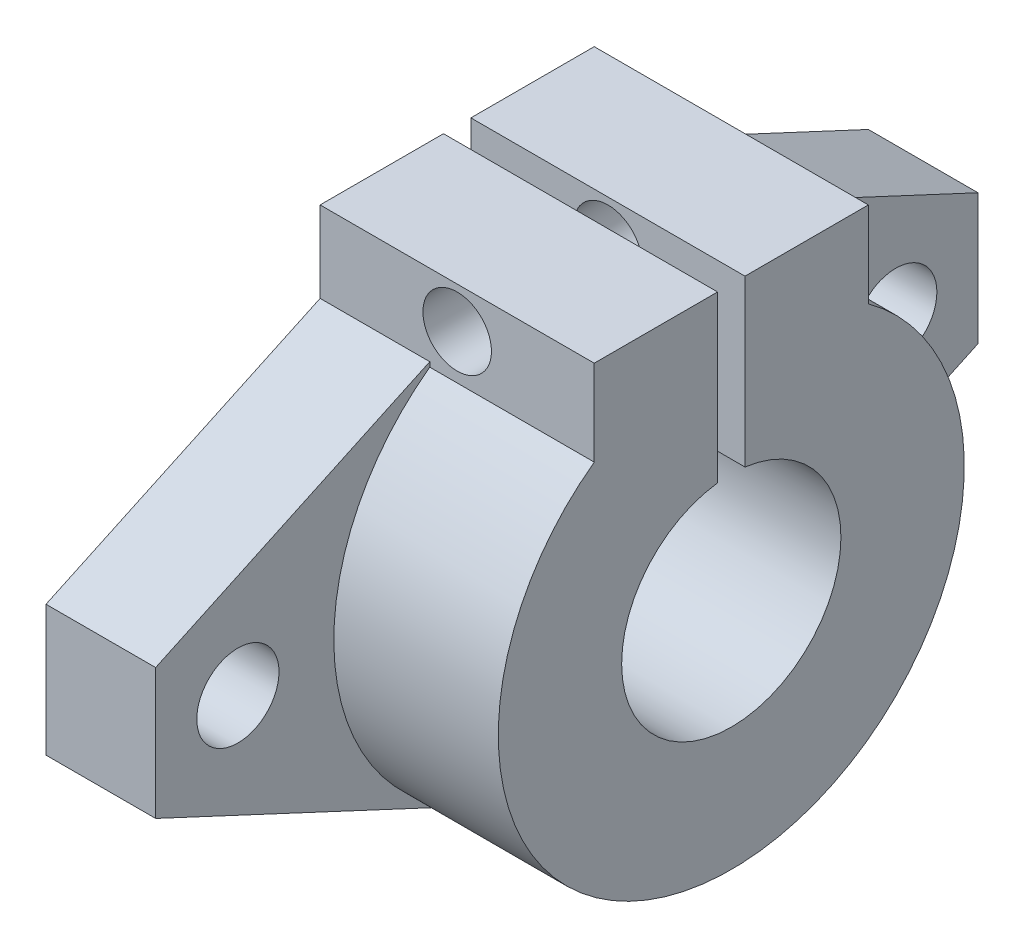
ISO-10303-21;
HEADER;
FILE_DESCRIPTION(('STEP AP214'),'2;1');
FILE_NAME('part.step','',(''),(''),'','','');
FILE_SCHEMA(('AUTOMOTIVE_DESIGN { 1 0 10303 214 1 1 1 1 }'));
ENDSEC;
DATA;
#1=APPLICATION_CONTEXT('core data for automotive mechanical design processes');
#2=APPLICATION_PROTOCOL_DEFINITION('international standard','automotive_design',2000,#1);
#3=PRODUCT_CONTEXT('',#1,'mechanical');
#4=PRODUCT('Part','Part','',(#3));
#5=PRODUCT_RELATED_PRODUCT_CATEGORY('part','',(#4));
#6=PRODUCT_DEFINITION_FORMATION('','',#4);
#7=PRODUCT_DEFINITION_CONTEXT('part definition',#1,'design');
#8=PRODUCT_DEFINITION('design','',#6,#7);
#9=PRODUCT_DEFINITION_SHAPE('','',#8);
#10=(LENGTH_UNIT() NAMED_UNIT(*) SI_UNIT(.MILLI.,.METRE.));
#11=(NAMED_UNIT(*) PLANE_ANGLE_UNIT() SI_UNIT($,.RADIAN.));
#12=(NAMED_UNIT(*) SI_UNIT($,.STERADIAN.) SOLID_ANGLE_UNIT());
#13=UNCERTAINTY_MEASURE_WITH_UNIT(LENGTH_MEASURE(1.E-05),#10,'distance_accuracy_value','');
#14=(GEOMETRIC_REPRESENTATION_CONTEXT(3) GLOBAL_UNCERTAINTY_ASSIGNED_CONTEXT((#13)) GLOBAL_UNIT_ASSIGNED_CONTEXT((#10,
#11,#12)) REPRESENTATION_CONTEXT('',''));
#15=CARTESIAN_POINT('',(0.,0.,0.));
#16=DIRECTION('',(0.,0.,1.));
#17=DIRECTION('',(1.,0.,0.));
#18=AXIS2_PLACEMENT_3D('',#15,#16,#17);
#19=CARTESIAN_POINT('',(0.,20.,0.));
#20=DIRECTION('',(0.,-1.,0.));
#21=DIRECTION('',(0.,0.,-1.));
#22=AXIS2_PLACEMENT_3D('',#19,#20,#21);
#23=PLANE('',#22);
#24=DIRECTION('',(0.,0.,-1.));
#25=VECTOR('',#24,1.);
#26=CARTESIAN_POINT('',(20.,20.,10.));
#27=LINE('',#26,#25);
#28=CARTESIAN_POINT('',(20.,20.,10.));
#29=VERTEX_POINT('',#28);
#30=CARTESIAN_POINT('',(20.,20.,1.));
#31=VERTEX_POINT('',#30);
#32=EDGE_CURVE('E305',#29,#31,#27,.T.);
#33=ORIENTED_EDGE('',*,*,#32,.T.);
#34=DIRECTION('',(1.,0.,0.));
#35=VECTOR('',#34,1.);
#36=CARTESIAN_POINT('',(0.,20.,1.));
#37=LINE('',#36,#35);
#38=CARTESIAN_POINT('',(0.,20.,1.));
#39=VERTEX_POINT('',#38);
#40=EDGE_CURVE('E155',#39,#31,#37,.T.);
#41=ORIENTED_EDGE('',*,*,#40,.F.);
#42=DIRECTION('',(0.,0.,-1.));
#43=VECTOR('',#42,1.);
#44=CARTESIAN_POINT('',(0.,20.,10.));
#45=LINE('',#44,#43);
#46=CARTESIAN_POINT('',(0.,20.,10.));
#47=VERTEX_POINT('',#46);
#48=EDGE_CURVE('E173',#47,#39,#45,.T.);
#49=ORIENTED_EDGE('',*,*,#48,.F.);
#50=DIRECTION('',(1.,0.,0.));
#51=VECTOR('',#50,1.);
#52=CARTESIAN_POINT('',(0.,20.,10.));
#53=LINE('',#52,#51);
#54=EDGE_CURVE('E180',#47,#29,#53,.T.);
#55=ORIENTED_EDGE('',*,*,#54,.T.);
#56=EDGE_LOOP('',(#33,#41,#49,#55));
#57=FACE_BOUND('',#56,.T.);
#58=ADVANCED_FACE('F36',(#57),#23,.F.);
#59=CARTESIAN_POINT('',(20.,0.,0.));
#60=DIRECTION('',(-1.,0.,0.));
#61=DIRECTION('',(0.,0.,1.));
#62=AXIS2_PLACEMENT_3D('',#59,#60,#61);
#63=CYLINDRICAL_SURFACE('',#62,17.);
#64=DIRECTION('',(-1.,0.,0.));
#65=VECTOR('',#64,1.);
#66=CARTESIAN_POINT('',(20.,13.7477270848675,-10.));
#67=LINE('',#66,#65);
#68=CARTESIAN_POINT('',(8.,13.7477270848675,-10.));
#69=VERTEX_POINT('',#68);
#70=CARTESIAN_POINT('',(20.,13.7477270848675,-10.));
#71=VERTEX_POINT('',#70);
#72=EDGE_CURVE('E196',#69,#71,#67,.F.);
#73=ORIENTED_EDGE('',*,*,#72,.T.);
#74=CARTESIAN_POINT('',(20.,0.,0.));
#75=DIRECTION('',(1.,0.,0.));
#76=DIRECTION('',(0.,0.,-1.));
#77=AXIS2_PLACEMENT_3D('',#74,#75,#76);
#78=CIRCLE('',#77,17.);
#79=CARTESIAN_POINT('',(20.,13.7477270848763,10.));
#80=VERTEX_POINT('',#79);
#81=EDGE_CURVE('E240',#80,#71,#78,.T.);
#82=ORIENTED_EDGE('',*,*,#81,.F.);
#83=DIRECTION('',(-1.,0.,0.));
#84=VECTOR('',#83,1.);
#85=CARTESIAN_POINT('',(20.,13.7477270848675,10.));
#86=LINE('',#85,#84);
#87=CARTESIAN_POINT('',(8.,13.7477270848675,10.));
#88=VERTEX_POINT('',#87);
#89=EDGE_CURVE('E191',#88,#80,#86,.F.);
#90=ORIENTED_EDGE('',*,*,#89,.F.);
#91=CARTESIAN_POINT('',(8.,0.,0.));
#92=DIRECTION('',(1.,0.,0.));
#93=DIRECTION('',(0.,0.,-1.));
#94=AXIS2_PLACEMENT_3D('',#91,#92,#93);
#95=CIRCLE('',#94,17.);
#96=CARTESIAN_POINT('',(8.,-15.4072323796231,7.18451044959185));
#97=VERTEX_POINT('',#96);
#98=EDGE_CURVE('E250',#88,#97,#95,.T.);
#99=ORIENTED_EDGE('',*,*,#98,.T.);
#100=DIRECTION('',(-1.,0.,0.));
#101=VECTOR('',#100,1.);
#102=CARTESIAN_POINT('',(8.,-15.4072323796231,7.18451044959185));
#103=LINE('',#102,#101);
#104=CARTESIAN_POINT('',(0.,-15.4072323796231,7.18451044959185));
#105=VERTEX_POINT('',#104);
#106=EDGE_CURVE('E260',#97,#105,#103,.T.);
#107=ORIENTED_EDGE('',*,*,#106,.T.);
#108=CARTESIAN_POINT('',(0.,0.,0.));
#109=DIRECTION('',(1.,0.,0.));
#110=DIRECTION('',(0.,0.,-1.));
#111=AXIS2_PLACEMENT_3D('',#108,#109,#110);
#112=CIRCLE('',#111,17.);
#113=CARTESIAN_POINT('',(0.,-15.4072323796231,-7.18451044959186));
#114=VERTEX_POINT('',#113);
#115=EDGE_CURVE('E241',#105,#114,#112,.T.);
#116=ORIENTED_EDGE('',*,*,#115,.T.);
#117=DIRECTION('',(-1.,0.,0.));
#118=VECTOR('',#117,1.);
#119=CARTESIAN_POINT('',(8.,-15.4072323796231,-7.18451044959186));
#120=LINE('',#119,#118);
#121=CARTESIAN_POINT('',(8.,-15.4072323796231,-7.18451044959186));
#122=VERTEX_POINT('',#121);
#123=EDGE_CURVE('E234',#122,#114,#120,.T.);
#124=ORIENTED_EDGE('',*,*,#123,.F.);
#125=CARTESIAN_POINT('',(8.,0.,0.));
#126=DIRECTION('',(1.,0.,0.));
#127=DIRECTION('',(0.,0.,-1.));
#128=AXIS2_PLACEMENT_3D('',#125,#126,#127);
#129=CIRCLE('',#128,17.);
#130=EDGE_CURVE('E206',#122,#69,#129,.T.);
#131=ORIENTED_EDGE('',*,*,#130,.T.);
#132=EDGE_LOOP('',(#73,#82,#90,#99,#107,#116,#124,#131));
#133=FACE_BOUND('',#132,.T.);
#134=ADVANCED_FACE('F286',(#133),#63,.T.);
#135=CARTESIAN_POINT('',(8.,15.4072323796231,-7.18451044959185));
#136=DIRECTION('',(0.,0.906307787036651,-0.422618261740697));
#137=DIRECTION('',(0.,0.422618261740697,0.906307787036651));
#138=AXIS2_PLACEMENT_3D('',#135,#136,#137);
#139=PLANE('',#138);
#140=DIRECTION('',(0.,-0.422618261740697,-0.906307787036651));
#141=VECTOR('',#140,1.);
#142=CARTESIAN_POINT('',(0.,15.4072323796231,-7.18451044959185));
#143=LINE('',#142,#141);
#144=CARTESIAN_POINT('',(0.,14.0943480407714,-10.));
#145=VERTEX_POINT('',#144);
#146=CARTESIAN_POINT('',(0.,4.76819487771248,-30.));
#147=VERTEX_POINT('',#146);
#148=EDGE_CURVE('E226',#145,#147,#143,.T.);
#149=ORIENTED_EDGE('',*,*,#148,.F.);
#150=DIRECTION('',(-1.,0.,0.));
#151=VECTOR('',#150,1.);
#152=CARTESIAN_POINT('',(0.,14.0943480407714,-10.));
#153=LINE('',#152,#151);
#154=CARTESIAN_POINT('',(8.,14.0943480408214,-9.99999999999759));
#155=VERTEX_POINT('',#154);
#156=EDGE_CURVE('E202',#155,#145,#153,.T.);
#157=ORIENTED_EDGE('',*,*,#156,.F.);
#158=DIRECTION('',(0.,-0.422618261740697,-0.906307787036651));
#159=VECTOR('',#158,1.);
#160=CARTESIAN_POINT('',(8.,15.4072323796231,-7.18451044959185));
#161=LINE('',#160,#159);
#162=CARTESIAN_POINT('',(8.,4.76819487771248,-30.));
#163=VERTEX_POINT('',#162);
#164=EDGE_CURVE('E215',#155,#163,#161,.T.);
#165=ORIENTED_EDGE('',*,*,#164,.T.);
#166=DIRECTION('',(-1.,0.,0.));
#167=VECTOR('',#166,1.);
#168=CARTESIAN_POINT('',(8.,4.76819487771248,-30.));
#169=LINE('',#168,#167);
#170=EDGE_CURVE('E220',#163,#147,#169,.T.);
#171=ORIENTED_EDGE('',*,*,#170,.T.);
#172=EDGE_LOOP('',(#149,#157,#165,#171));
#173=FACE_BOUND('',#172,.T.);
#174=ADVANCED_FACE('F345',(#173),#139,.T.);
#175=CARTESIAN_POINT('',(8.,0.,0.));
#176=DIRECTION('',(1.,0.,0.));
#177=DIRECTION('',(0.,0.,-1.));
#178=AXIS2_PLACEMENT_3D('',#175,#176,#177);
#179=PLANE('',#178);
#180=CARTESIAN_POINT('',(8.,0.,-24.));
#181=DIRECTION('',(1.,0.,0.));
#182=DIRECTION('',(0.,0.,-1.));
#183=AXIS2_PLACEMENT_3D('',#180,#181,#182);
#184=CIRCLE('',#183,3.);
#185=CARTESIAN_POINT('',(8.,0.,-27.));
#186=VERTEX_POINT('',#185);
#187=EDGE_CURVE('E217',#186,#186,#184,.F.);
#188=ORIENTED_EDGE('',*,*,#187,.T.);
#189=EDGE_LOOP('',(#188));
#190=FACE_BOUND('',#189,.T.);
#191=ORIENTED_EDGE('',*,*,#164,.F.);
#192=DIRECTION('',(0.,1.,0.));
#193=VECTOR('',#192,1.);
#194=CARTESIAN_POINT('',(8.,-500000.,-10.));
#195=LINE('',#194,#193);
#196=EDGE_CURVE('E200',#69,#155,#195,.T.);
#197=ORIENTED_EDGE('',*,*,#196,.F.);
#198=ORIENTED_EDGE('',*,*,#130,.F.);
#199=DIRECTION('',(0.,0.422618261740697,-0.906307787036651));
#200=VECTOR('',#199,1.);
#201=CARTESIAN_POINT('',(8.,-15.4072323796231,-7.18451044959185));
#202=LINE('',#201,#200);
#203=CARTESIAN_POINT('',(8.,-4.76819487771248,-30.));
#204=VERTEX_POINT('',#203);
#205=EDGE_CURVE('E209',#122,#204,#202,.T.);
#206=ORIENTED_EDGE('',*,*,#205,.T.);
#207=DIRECTION('',(0.,-1.,0.));
#208=VECTOR('',#207,1.);
#209=CARTESIAN_POINT('',(8.,0.,-30.));
#210=LINE('',#209,#208);
#211=EDGE_CURVE('E212',#163,#204,#210,.T.);
#212=ORIENTED_EDGE('',*,*,#211,.F.);
#213=EDGE_LOOP('',(#191,#197,#198,#206,#212));
#214=FACE_BOUND('',#213,.T.);
#215=ADVANCED_FACE('F453',(#190,#214),#179,.T.);
#216=CARTESIAN_POINT('',(8.,15.4072323796231,7.18451044959185));
#217=DIRECTION('',(0.,-0.906307787036651,-0.422618261740697));
#218=DIRECTION('',(0.,0.422618261740697,-0.906307787036651));
#219=AXIS2_PLACEMENT_3D('',#216,#217,#218);
#220=PLANE('',#219);
#221=DIRECTION('',(0.,-0.422618261740697,0.906307787036651));
#222=VECTOR('',#221,1.);
#223=CARTESIAN_POINT('',(8.,15.4072323796231,7.18451044959185));
#224=LINE('',#223,#222);
#225=CARTESIAN_POINT('',(8.,14.0943480408214,9.99999999999759));
#226=VERTEX_POINT('',#225);
#227=CARTESIAN_POINT('',(8.,4.76819487771247,30.));
#228=VERTEX_POINT('',#227);
#229=EDGE_CURVE('E253',#226,#228,#224,.T.);
#230=ORIENTED_EDGE('',*,*,#229,.F.);
#231=DIRECTION('',(1.,0.,0.));
#232=VECTOR('',#231,1.);
#233=CARTESIAN_POINT('',(0.,14.0943480407714,10.));
#234=LINE('',#233,#232);
#235=CARTESIAN_POINT('',(0.,14.0943480408282,10.));
#236=VERTEX_POINT('',#235);
#237=EDGE_CURVE('E198',#236,#226,#234,.T.);
#238=ORIENTED_EDGE('',*,*,#237,.F.);
#239=DIRECTION('',(0.,-0.422618261740697,0.906307787036651));
#240=VECTOR('',#239,1.);
#241=CARTESIAN_POINT('',(0.,15.4072323796231,7.18451044959185));
#242=LINE('',#241,#240);
#243=CARTESIAN_POINT('',(0.,4.76819487771247,30.));
#244=VERTEX_POINT('',#243);
#245=EDGE_CURVE('E263',#236,#244,#242,.T.);
#246=ORIENTED_EDGE('',*,*,#245,.T.);
#247=DIRECTION('',(-1.,0.,0.));
#248=VECTOR('',#247,1.);
#249=CARTESIAN_POINT('',(8.,4.76819487771247,30.));
#250=LINE('',#249,#248);
#251=EDGE_CURVE('E11',#228,#244,#250,.T.);
#252=ORIENTED_EDGE('',*,*,#251,.F.);
#253=EDGE_LOOP('',(#230,#238,#246,#252));
#254=FACE_BOUND('',#253,.T.);
#255=ADVANCED_FACE('F294',(#254),#220,.F.);
#256=CARTESIAN_POINT('',(8.,0.,30.));
#257=DIRECTION('',(0.,0.,-1.));
#258=DIRECTION('',(-1.,0.,0.));
#259=AXIS2_PLACEMENT_3D('',#256,#257,#258);
#260=PLANE('',#259);
#261=DIRECTION('',(0.,-1.,0.));
#262=VECTOR('',#261,1.);
#263=CARTESIAN_POINT('',(0.,0.,30.));
#264=LINE('',#263,#262);
#265=CARTESIAN_POINT('',(0.,-4.76819487771247,30.));
#266=VERTEX_POINT('',#265);
#267=EDGE_CURVE('E265',#244,#266,#264,.T.);
#268=ORIENTED_EDGE('',*,*,#267,.T.);
#269=DIRECTION('',(-1.,0.,0.));
#270=VECTOR('',#269,1.);
#271=CARTESIAN_POINT('',(8.,-4.76819487771247,30.));
#272=LINE('',#271,#270);
#273=CARTESIAN_POINT('',(8.,-4.76819487771247,30.));
#274=VERTEX_POINT('',#273);
#275=EDGE_CURVE('E45',#274,#266,#272,.T.);
#276=ORIENTED_EDGE('',*,*,#275,.F.);
#277=DIRECTION('',(0.,-1.,0.));
#278=VECTOR('',#277,1.);
#279=CARTESIAN_POINT('',(8.,0.,30.));
#280=LINE('',#279,#278);
#281=EDGE_CURVE('E255',#228,#274,#280,.T.);
#282=ORIENTED_EDGE('',*,*,#281,.F.);
#283=ORIENTED_EDGE('',*,*,#251,.T.);
#284=EDGE_LOOP('',(#268,#276,#282,#283));
#285=FACE_BOUND('',#284,.T.);
#286=ADVANCED_FACE('F281',(#285),#260,.F.);
#287=CARTESIAN_POINT('',(8.,0.,24.));
#288=DIRECTION('',(-1.,0.,0.));
#289=DIRECTION('',(0.,0.,1.));
#290=AXIS2_PLACEMENT_3D('',#287,#288,#289);
#291=CYLINDRICAL_SURFACE('',#290,3.);
#292=CARTESIAN_POINT('',(8.,0.,24.));
#293=DIRECTION('',(1.,0.,0.));
#294=DIRECTION('',(0.,0.,-1.));
#295=AXIS2_PLACEMENT_3D('',#292,#293,#294);
#296=CIRCLE('',#295,3.);
#297=CARTESIAN_POINT('',(8.,0.,21.));
#298=VERTEX_POINT('',#297);
#299=EDGE_CURVE('E247',#298,#298,#296,.T.);
#300=ORIENTED_EDGE('',*,*,#299,.T.);
#301=EDGE_LOOP('',(#300));
#302=FACE_BOUND('',#301,.T.);
#303=CARTESIAN_POINT('',(0.,0.,24.));
#304=DIRECTION('',(1.,0.,0.));
#305=DIRECTION('',(0.,0.,-1.));
#306=AXIS2_PLACEMENT_3D('',#303,#304,#305);
#307=CIRCLE('',#306,3.);
#308=CARTESIAN_POINT('',(0.,0.,21.));
#309=VERTEX_POINT('',#308);
#310=EDGE_CURVE('E244',#309,#309,#307,.T.);
#311=ORIENTED_EDGE('',*,*,#310,.F.);
#312=EDGE_LOOP('',(#311));
#313=FACE_BOUND('',#312,.T.);
#314=ADVANCED_FACE('F38',(#302,#313),#291,.F.);
#315=CARTESIAN_POINT('',(8.,-15.4072323796231,7.18451044959185));
#316=DIRECTION('',(0.,-0.906307787036651,0.422618261740697));
#317=DIRECTION('',(0.,-0.422618261740697,-0.906307787036651));
#318=AXIS2_PLACEMENT_3D('',#315,#316,#317);
#319=PLANE('',#318);
#320=DIRECTION('',(0.,0.422618261740697,0.906307787036651));
#321=VECTOR('',#320,1.);
#322=CARTESIAN_POINT('',(0.,-15.4072323796231,7.18451044959185));
#323=LINE('',#322,#321);
#324=EDGE_CURVE('E251',#105,#266,#323,.T.);
#325=ORIENTED_EDGE('',*,*,#324,.F.);
#326=ORIENTED_EDGE('',*,*,#106,.F.);
#327=DIRECTION('',(0.,0.422618261740697,0.906307787036651));
#328=VECTOR('',#327,1.);
#329=CARTESIAN_POINT('',(8.,-15.4072323796231,7.18451044959185));
#330=LINE('',#329,#328);
#331=EDGE_CURVE('E257',#97,#274,#330,.T.);
#332=ORIENTED_EDGE('',*,*,#331,.T.);
#333=ORIENTED_EDGE('',*,*,#275,.T.);
#334=EDGE_LOOP('',(#325,#326,#332,#333));
#335=FACE_BOUND('',#334,.T.);
#336=ADVANCED_FACE('F275',(#335),#319,.T.);
#337=CARTESIAN_POINT('',(8.,0.,0.));
#338=DIRECTION('',(1.,0.,0.));
#339=DIRECTION('',(0.,0.,-1.));
#340=AXIS2_PLACEMENT_3D('',#337,#338,#339);
#341=PLANE('',#340);
#342=DIRECTION('',(0.,1.,0.));
#343=VECTOR('',#342,1.);
#344=CARTESIAN_POINT('',(8.,-500000.,10.));
#345=LINE('',#344,#343);
#346=EDGE_CURVE('E192',#88,#226,#345,.T.);
#347=ORIENTED_EDGE('',*,*,#346,.T.);
#348=ORIENTED_EDGE('',*,*,#229,.T.);
#349=ORIENTED_EDGE('',*,*,#281,.T.);
#350=ORIENTED_EDGE('',*,*,#331,.F.);
#351=ORIENTED_EDGE('',*,*,#98,.F.);
#352=EDGE_LOOP('',(#347,#348,#349,#350,#351));
#353=FACE_BOUND('',#352,.T.);
#354=ORIENTED_EDGE('',*,*,#299,.F.);
#355=EDGE_LOOP('',(#354));
#356=FACE_BOUND('',#355,.T.);
#357=ADVANCED_FACE('F290',(#353,#356),#341,.T.);
#358=CARTESIAN_POINT('',(0.,0.,0.));
#359=DIRECTION('',(1.,0.,0.));
#360=DIRECTION('',(0.,0.,-1.));
#361=AXIS2_PLACEMENT_3D('',#358,#359,#360);
#362=PLANE('',#361);
#363=ORIENTED_EDGE('',*,*,#310,.T.);
#364=EDGE_LOOP('',(#363));
#365=FACE_BOUND('',#364,.T.);
#366=ORIENTED_EDGE('',*,*,#48,.T.);
#367=DIRECTION('',(0.,1.,0.));
#368=VECTOR('',#367,1.);
#369=CARTESIAN_POINT('',(0.,0.,1.));
#370=LINE('',#369,#368);
#371=CARTESIAN_POINT('',(0.,7.93725393319377,1.));
#372=VERTEX_POINT('',#371);
#373=EDGE_CURVE('E60',#372,#39,#370,.T.);
#374=ORIENTED_EDGE('',*,*,#373,.F.);
#375=CARTESIAN_POINT('',(0.,0.,0.));
#376=DIRECTION('',(1.,0.,0.));
#377=DIRECTION('',(0.,0.,-1.));
#378=AXIS2_PLACEMENT_3D('',#375,#376,#377);
#379=CIRCLE('',#378,8.);
#380=CARTESIAN_POINT('',(0.,7.93725393319377,-1.));
#381=VERTEX_POINT('',#380);
#382=EDGE_CURVE('E167',#372,#381,#379,.T.);
#383=ORIENTED_EDGE('',*,*,#382,.T.);
#384=DIRECTION('',(0.,1.,0.));
#385=VECTOR('',#384,1.);
#386=CARTESIAN_POINT('',(0.,0.,-1.));
#387=LINE('',#386,#385);
#388=CARTESIAN_POINT('',(0.,20.,-1.));
#389=VERTEX_POINT('',#388);
#390=EDGE_CURVE('E150',#381,#389,#387,.T.);
#391=ORIENTED_EDGE('',*,*,#390,.T.);
#392=CARTESIAN_POINT('',(0.,20.,-10.));
#393=VERTEX_POINT('',#392);
#394=EDGE_CURVE('E164',#389,#393,#45,.T.);
#395=ORIENTED_EDGE('',*,*,#394,.T.);
#396=DIRECTION('',(0.,1.,0.));
#397=VECTOR('',#396,1.);
#398=CARTESIAN_POINT('',(0.,-500000.,-10.));
#399=LINE('',#398,#397);
#400=EDGE_CURVE('E189',#145,#393,#399,.T.);
#401=ORIENTED_EDGE('',*,*,#400,.F.);
#402=ORIENTED_EDGE('',*,*,#148,.T.);
#403=DIRECTION('',(0.,-1.,0.));
#404=VECTOR('',#403,1.);
#405=CARTESIAN_POINT('',(0.,0.,-30.));
#406=LINE('',#405,#404);
#407=CARTESIAN_POINT('',(0.,-4.76819487771248,-30.));
#408=VERTEX_POINT('',#407);
#409=EDGE_CURVE('E223',#147,#408,#406,.T.);
#410=ORIENTED_EDGE('',*,*,#409,.T.);
#411=DIRECTION('',(0.,0.422618261740697,-0.906307787036651));
#412=VECTOR('',#411,1.);
#413=CARTESIAN_POINT('',(0.,-15.4072323796231,-7.18451044959185));
#414=LINE('',#413,#412);
#415=EDGE_CURVE('E195',#114,#408,#414,.T.);
#416=ORIENTED_EDGE('',*,*,#415,.F.);
#417=ORIENTED_EDGE('',*,*,#115,.F.);
#418=ORIENTED_EDGE('',*,*,#324,.T.);
#419=ORIENTED_EDGE('',*,*,#267,.F.);
#420=ORIENTED_EDGE('',*,*,#245,.F.);
#421=DIRECTION('',(0.,1.,0.));
#422=VECTOR('',#421,1.);
#423=CARTESIAN_POINT('',(0.,-500000.,10.));
#424=LINE('',#423,#422);
#425=EDGE_CURVE('E182',#236,#47,#424,.T.);
#426=ORIENTED_EDGE('',*,*,#425,.T.);
#427=EDGE_LOOP('',(#366,#374,#383,#391,#395,#401,#402,#410,#416,#417,#418,#419,#420,#426));
#428=FACE_BOUND('',#427,.T.);
#429=CARTESIAN_POINT('',(0.,0.,-24.));
#430=DIRECTION('',(1.,0.,0.));
#431=DIRECTION('',(0.,0.,-1.));
#432=AXIS2_PLACEMENT_3D('',#429,#430,#431);
#433=CIRCLE('',#432,3.);
#434=CARTESIAN_POINT('',(0.,0.,-27.));
#435=VERTEX_POINT('',#434);
#436=EDGE_CURVE('E210',#435,#435,#433,.F.);
#437=ORIENTED_EDGE('',*,*,#436,.F.);
#438=EDGE_LOOP('',(#437));
#439=FACE_BOUND('',#438,.T.);
#440=ADVANCED_FACE('F161',(#365,#428,#439),#362,.F.);
#441=CARTESIAN_POINT('',(20.,0.,0.));
#442=DIRECTION('',(-1.,0.,0.));
#443=DIRECTION('',(0.,0.,1.));
#444=AXIS2_PLACEMENT_3D('',#441,#442,#443);
#445=CYLINDRICAL_SURFACE('',#444,8.);
#446=DIRECTION('',(-1.,0.,0.));
#447=VECTOR('',#446,1.);
#448=CARTESIAN_POINT('',(20.,7.93725393319377,1.));
#449=LINE('',#448,#447);
#450=CARTESIAN_POINT('',(20.,7.93725393319377,1.));
#451=VERTEX_POINT('',#450);
#452=EDGE_CURVE('E174',#451,#372,#449,.T.);
#453=ORIENTED_EDGE('',*,*,#452,.F.);
#454=CARTESIAN_POINT('',(20.,0.,0.));
#455=DIRECTION('',(1.,0.,0.));
#456=DIRECTION('',(0.,0.,-1.));
#457=AXIS2_PLACEMENT_3D('',#454,#455,#456);
#458=CIRCLE('',#457,8.);
#459=CARTESIAN_POINT('',(20.,7.93725393319377,-1.));
#460=VERTEX_POINT('',#459);
#461=EDGE_CURVE('E237',#451,#460,#458,.T.);
#462=ORIENTED_EDGE('',*,*,#461,.T.);
#463=DIRECTION('',(-1.,0.,0.));
#464=VECTOR('',#463,1.);
#465=CARTESIAN_POINT('',(20.,7.93725393319377,-1.));
#466=LINE('',#465,#464);
#467=EDGE_CURVE('E176',#381,#460,#466,.F.);
#468=ORIENTED_EDGE('',*,*,#467,.F.);
#469=ORIENTED_EDGE('',*,*,#382,.F.);
#470=EDGE_LOOP('',(#453,#462,#468,#469));
#471=FACE_BOUND('',#470,.T.);
#472=ADVANCED_FACE('F423',(#471),#445,.F.);
#473=CARTESIAN_POINT('',(20.,0.,0.));
#474=DIRECTION('',(1.,0.,0.));
#475=DIRECTION('',(0.,0.,-1.));
#476=AXIS2_PLACEMENT_3D('',#473,#474,#475);
#477=PLANE('',#476);
#478=DIRECTION('',(0.,1.,0.));
#479=VECTOR('',#478,1.);
#480=CARTESIAN_POINT('',(20.,0.,1.));
#481=LINE('',#480,#479);
#482=EDGE_CURVE('E310',#451,#31,#481,.T.);
#483=ORIENTED_EDGE('',*,*,#482,.T.);
#484=ORIENTED_EDGE('',*,*,#32,.F.);
#485=DIRECTION('',(0.,1.,0.));
#486=VECTOR('',#485,1.);
#487=CARTESIAN_POINT('',(20.,-500000.,10.));
#488=LINE('',#487,#486);
#489=EDGE_CURVE('E184',#80,#29,#488,.T.);
#490=ORIENTED_EDGE('',*,*,#489,.F.);
#491=ORIENTED_EDGE('',*,*,#81,.T.);
#492=DIRECTION('',(0.,1.,0.));
#493=VECTOR('',#492,1.);
#494=CARTESIAN_POINT('',(20.,-500000.,-10.));
#495=LINE('',#494,#493);
#496=CARTESIAN_POINT('',(20.,20.,-10.));
#497=VERTEX_POINT('',#496);
#498=EDGE_CURVE('E186',#71,#497,#495,.T.);
#499=ORIENTED_EDGE('',*,*,#498,.T.);
#500=CARTESIAN_POINT('',(20.,20.,-1.));
#501=VERTEX_POINT('',#500);
#502=EDGE_CURVE('E306',#501,#497,#27,.T.);
#503=ORIENTED_EDGE('',*,*,#502,.F.);
#504=DIRECTION('',(0.,1.,0.));
#505=VECTOR('',#504,1.);
#506=CARTESIAN_POINT('',(20.,0.,-1.));
#507=LINE('',#506,#505);
#508=EDGE_CURVE('E52',#460,#501,#507,.T.);
#509=ORIENTED_EDGE('',*,*,#508,.F.);
#510=ORIENTED_EDGE('',*,*,#461,.F.);
#511=EDGE_LOOP('',(#483,#484,#490,#491,#499,#503,#509,#510));
#512=FACE_BOUND('',#511,.T.);
#513=ADVANCED_FACE('F416',(#512),#477,.T.);
#514=CARTESIAN_POINT('',(8.,-15.4072323796231,-7.18451044959185));
#515=DIRECTION('',(0.,0.906307787036651,0.422618261740697));
#516=DIRECTION('',(0.,-0.422618261740697,0.906307787036651));
#517=AXIS2_PLACEMENT_3D('',#514,#515,#516);
#518=PLANE('',#517);
#519=ORIENTED_EDGE('',*,*,#415,.T.);
#520=DIRECTION('',(-1.,0.,0.));
#521=VECTOR('',#520,1.);
#522=CARTESIAN_POINT('',(8.,-4.76819487771248,-30.));
#523=LINE('',#522,#521);
#524=EDGE_CURVE('E232',#204,#408,#523,.T.);
#525=ORIENTED_EDGE('',*,*,#524,.F.);
#526=ORIENTED_EDGE('',*,*,#205,.F.);
#527=ORIENTED_EDGE('',*,*,#123,.T.);
#528=EDGE_LOOP('',(#519,#525,#526,#527));
#529=FACE_BOUND('',#528,.T.);
#530=ADVANCED_FACE('F422',(#529),#518,.F.);
#531=CARTESIAN_POINT('',(8.,0.,-30.));
#532=DIRECTION('',(0.,0.,-1.));
#533=DIRECTION('',(-1.,0.,0.));
#534=AXIS2_PLACEMENT_3D('',#531,#532,#533);
#535=PLANE('',#534);
#536=ORIENTED_EDGE('',*,*,#409,.F.);
#537=ORIENTED_EDGE('',*,*,#170,.F.);
#538=ORIENTED_EDGE('',*,*,#211,.T.);
#539=ORIENTED_EDGE('',*,*,#524,.T.);
#540=EDGE_LOOP('',(#536,#537,#538,#539));
#541=FACE_BOUND('',#540,.T.);
#542=ADVANCED_FACE('F362',(#541),#535,.T.);
#543=CARTESIAN_POINT('',(8.,0.,-24.));
#544=DIRECTION('',(-1.,0.,0.));
#545=DIRECTION('',(0.,0.,1.));
#546=AXIS2_PLACEMENT_3D('',#543,#544,#545);
#547=CYLINDRICAL_SURFACE('',#546,3.);
#548=ORIENTED_EDGE('',*,*,#187,.F.);
#549=EDGE_LOOP('',(#548));
#550=FACE_BOUND('',#549,.T.);
#551=ORIENTED_EDGE('',*,*,#436,.T.);
#552=EDGE_LOOP('',(#551));
#553=FACE_BOUND('',#552,.T.);
#554=ADVANCED_FACE('F356',(#550,#553),#547,.F.);
#555=CARTESIAN_POINT('',(0.,-500000.,-10.));
#556=DIRECTION('',(0.,0.,1.));
#557=DIRECTION('',(1.,0.,0.));
#558=AXIS2_PLACEMENT_3D('',#555,#556,#557);
#559=PLANE('',#558);
#560=CARTESIAN_POINT('',(10.,17.,-10.));
#561=DIRECTION('',(0.,0.,1.));
#562=DIRECTION('',(1.,0.,0.));
#563=AXIS2_PLACEMENT_3D('',#560,#561,#562);
#564=CIRCLE('',#563,2.5);
#565=CARTESIAN_POINT('',(12.5,17.,-10.));
#566=VERTEX_POINT('',#565);
#567=EDGE_CURVE('E156',#566,#566,#564,.T.);
#568=ORIENTED_EDGE('',*,*,#567,.T.);
#569=EDGE_LOOP('',(#568));
#570=FACE_BOUND('',#569,.T.);
#571=ORIENTED_EDGE('',*,*,#196,.T.);
#572=ORIENTED_EDGE('',*,*,#156,.T.);
#573=ORIENTED_EDGE('',*,*,#400,.T.);
#574=DIRECTION('',(1.,0.,0.));
#575=VECTOR('',#574,1.);
#576=CARTESIAN_POINT('',(0.,20.,-10.));
#577=LINE('',#576,#575);
#578=EDGE_CURVE('E172',#393,#497,#577,.T.);
#579=ORIENTED_EDGE('',*,*,#578,.T.);
#580=ORIENTED_EDGE('',*,*,#498,.F.);
#581=ORIENTED_EDGE('',*,*,#72,.F.);
#582=EDGE_LOOP('',(#571,#572,#573,#579,#580,#581));
#583=FACE_BOUND('',#582,.T.);
#584=ADVANCED_FACE('F350',(#570,#583),#559,.F.);
#585=ORIENTED_EDGE('',*,*,#394,.F.);
#586=DIRECTION('',(-1.,0.,0.));
#587=VECTOR('',#586,1.);
#588=CARTESIAN_POINT('',(0.,20.,-1.));
#589=LINE('',#588,#587);
#590=EDGE_CURVE('E147',#501,#389,#589,.T.);
#591=ORIENTED_EDGE('',*,*,#590,.F.);
#592=ORIENTED_EDGE('',*,*,#502,.T.);
#593=ORIENTED_EDGE('',*,*,#578,.F.);
#594=EDGE_LOOP('',(#585,#591,#592,#593));
#595=FACE_BOUND('',#594,.T.);
#596=ADVANCED_FACE('F170',(#595),#23,.F.);
#597=CARTESIAN_POINT('',(0.,-500000.,10.));
#598=DIRECTION('',(0.,0.,1.));
#599=DIRECTION('',(1.,0.,0.));
#600=AXIS2_PLACEMENT_3D('',#597,#598,#599);
#601=PLANE('',#600);
#602=CARTESIAN_POINT('',(10.,17.,10.));
#603=DIRECTION('',(0.,0.,1.));
#604=DIRECTION('',(1.,0.,0.));
#605=AXIS2_PLACEMENT_3D('',#602,#603,#604);
#606=CIRCLE('',#605,2.5);
#607=CARTESIAN_POINT('',(12.5,17.,10.));
#608=VERTEX_POINT('',#607);
#609=EDGE_CURVE('E321',#608,#608,#606,.T.);
#610=ORIENTED_EDGE('',*,*,#609,.F.);
#611=EDGE_LOOP('',(#610));
#612=FACE_BOUND('',#611,.T.);
#613=ORIENTED_EDGE('',*,*,#425,.F.);
#614=ORIENTED_EDGE('',*,*,#237,.T.);
#615=ORIENTED_EDGE('',*,*,#346,.F.);
#616=ORIENTED_EDGE('',*,*,#89,.T.);
#617=ORIENTED_EDGE('',*,*,#489,.T.);
#618=ORIENTED_EDGE('',*,*,#54,.F.);
#619=EDGE_LOOP('',(#613,#614,#615,#616,#617,#618));
#620=FACE_BOUND('',#619,.T.);
#621=ADVANCED_FACE('F302',(#612,#620),#601,.T.);
#622=CARTESIAN_POINT('',(0.,0.,-1.));
#623=DIRECTION('',(0.,0.,-1.));
#624=DIRECTION('',(-1.,0.,0.));
#625=AXIS2_PLACEMENT_3D('',#622,#623,#624);
#626=PLANE('',#625);
#627=CARTESIAN_POINT('',(10.,17.,-1.));
#628=DIRECTION('',(0.,0.,-1.));
#629=DIRECTION('',(-1.,0.,0.));
#630=AXIS2_PLACEMENT_3D('',#627,#628,#629);
#631=CIRCLE('',#630,2.5);
#632=CARTESIAN_POINT('',(7.5,17.,-1.));
#633=VERTEX_POINT('',#632);
#634=EDGE_CURVE('E318',#633,#633,#631,.T.);
#635=ORIENTED_EDGE('',*,*,#634,.T.);
#636=EDGE_LOOP('',(#635));
#637=FACE_BOUND('',#636,.T.);
#638=ORIENTED_EDGE('',*,*,#467,.T.);
#639=ORIENTED_EDGE('',*,*,#508,.T.);
#640=ORIENTED_EDGE('',*,*,#590,.T.);
#641=ORIENTED_EDGE('',*,*,#390,.F.);
#642=EDGE_LOOP('',(#638,#639,#640,#641));
#643=FACE_BOUND('',#642,.T.);
#644=ADVANCED_FACE('F149',(#637,#643),#626,.F.);
#645=CARTESIAN_POINT('',(0.,0.,1.));
#646=DIRECTION('',(0.,0.,1.));
#647=DIRECTION('',(1.,0.,0.));
#648=AXIS2_PLACEMENT_3D('',#645,#646,#647);
#649=PLANE('',#648);
#650=CARTESIAN_POINT('',(10.,17.,1.));
#651=DIRECTION('',(0.,0.,1.));
#652=DIRECTION('',(1.,0.,0.));
#653=AXIS2_PLACEMENT_3D('',#650,#651,#652);
#654=CIRCLE('',#653,2.5);
#655=CARTESIAN_POINT('',(12.5,17.,1.));
#656=VERTEX_POINT('',#655);
#657=EDGE_CURVE('E40',#656,#656,#654,.T.);
#658=ORIENTED_EDGE('',*,*,#657,.T.);
#659=EDGE_LOOP('',(#658));
#660=FACE_BOUND('',#659,.T.);
#661=ORIENTED_EDGE('',*,*,#452,.T.);
#662=ORIENTED_EDGE('',*,*,#373,.T.);
#663=ORIENTED_EDGE('',*,*,#40,.T.);
#664=ORIENTED_EDGE('',*,*,#482,.F.);
#665=EDGE_LOOP('',(#661,#662,#663,#664));
#666=FACE_BOUND('',#665,.T.);
#667=ADVANCED_FACE('F328',(#660,#666),#649,.F.);
#668=CARTESIAN_POINT('',(10.,17.,-30.));
#669=DIRECTION('',(0.,0.,1.));
#670=DIRECTION('',(1.,0.,0.));
#671=AXIS2_PLACEMENT_3D('',#668,#669,#670);
#672=CYLINDRICAL_SURFACE('',#671,2.5);
#673=ORIENTED_EDGE('',*,*,#609,.T.);
#674=EDGE_LOOP('',(#673));
#675=FACE_BOUND('',#674,.T.);
#676=ORIENTED_EDGE('',*,*,#657,.F.);
#677=EDGE_LOOP('',(#676));
#678=FACE_BOUND('',#677,.T.);
#679=ADVANCED_FACE('F330',(#675,#678),#672,.F.);
#680=ORIENTED_EDGE('',*,*,#634,.F.);
#681=EDGE_LOOP('',(#680));
#682=FACE_BOUND('',#681,.T.);
#683=ORIENTED_EDGE('',*,*,#567,.F.);
#684=EDGE_LOOP('',(#683));
#685=FACE_BOUND('',#684,.T.);
#686=ADVANCED_FACE('F332',(#682,#685),#672,.F.);
#687=CLOSED_SHELL('',(#58,#134,#174,#215,#255,#286,#314,#336,#357,#440,#472,#513,#530,#542,#554,
#584,#596,#621,#644,#667,#679,#686));
#688=MANIFOLD_SOLID_BREP('B2',#687);
#689=ADVANCED_BREP_SHAPE_REPRESENTATION('',(#18,#688),#14);
#690=SHAPE_DEFINITION_REPRESENTATION(#9,#689);
ENDSEC;
END-ISO-10303-21;
